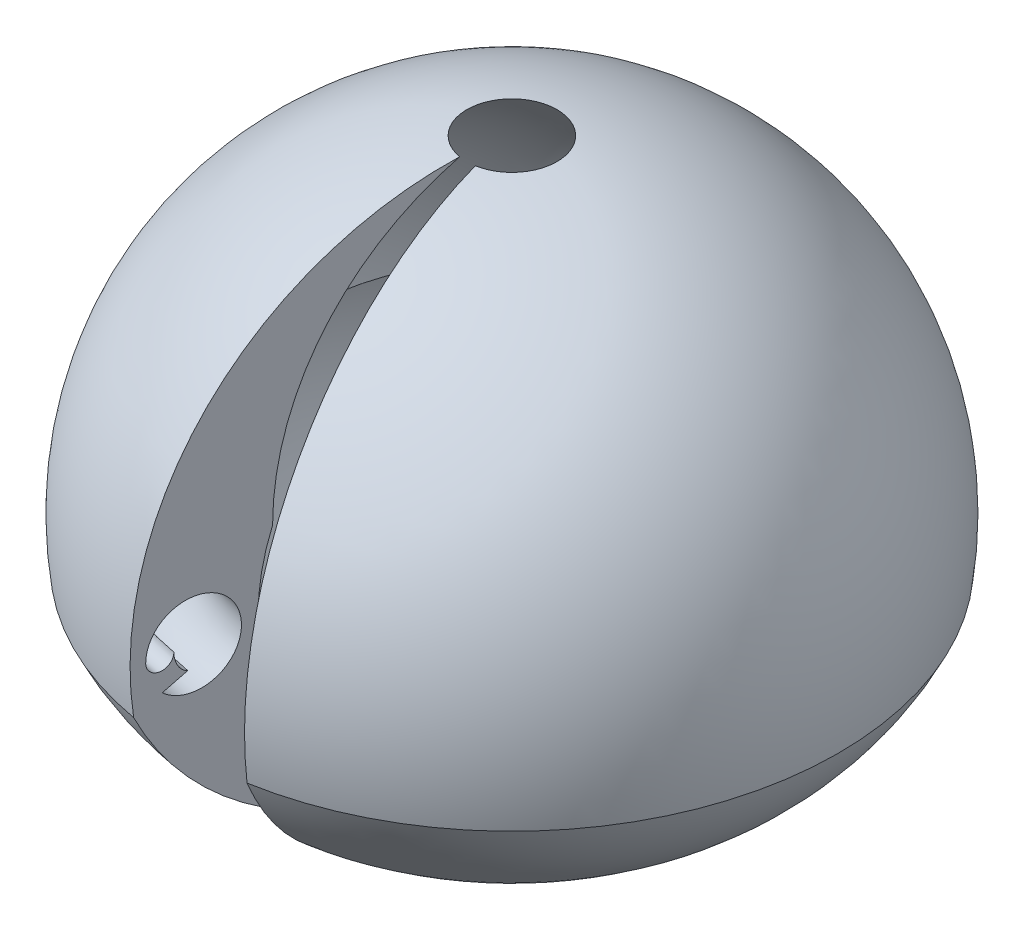
ISO-10303-21;
HEADER;
FILE_DESCRIPTION(('STEP AP214'),'2;1');
FILE_NAME('part.step','',(''),(''),'','','');
FILE_SCHEMA(('AUTOMOTIVE_DESIGN { 1 0 10303 214 1 1 1 1 }'));
ENDSEC;
DATA;
#1=APPLICATION_CONTEXT('core data for automotive mechanical design processes');
#2=APPLICATION_PROTOCOL_DEFINITION('international standard','automotive_design',2000,#1);
#3=PRODUCT_CONTEXT('',#1,'mechanical');
#4=PRODUCT('Part','Part','',(#3));
#5=PRODUCT_RELATED_PRODUCT_CATEGORY('part','',(#4));
#6=PRODUCT_DEFINITION_FORMATION('','',#4);
#7=PRODUCT_DEFINITION_CONTEXT('part definition',#1,'design');
#8=PRODUCT_DEFINITION('design','',#6,#7);
#9=PRODUCT_DEFINITION_SHAPE('','',#8);
#10=(LENGTH_UNIT() NAMED_UNIT(*) SI_UNIT(.MILLI.,.METRE.));
#11=(NAMED_UNIT(*) PLANE_ANGLE_UNIT() SI_UNIT($,.RADIAN.));
#12=(NAMED_UNIT(*) SI_UNIT($,.STERADIAN.) SOLID_ANGLE_UNIT());
#13=UNCERTAINTY_MEASURE_WITH_UNIT(LENGTH_MEASURE(1.E-05),#10,'distance_accuracy_value','');
#14=(GEOMETRIC_REPRESENTATION_CONTEXT(3) GLOBAL_UNCERTAINTY_ASSIGNED_CONTEXT((#13)) GLOBAL_UNIT_ASSIGNED_CONTEXT((#10,
#11,#12)) REPRESENTATION_CONTEXT('',''));
#15=CARTESIAN_POINT('',(0.,0.,0.));
#16=DIRECTION('',(0.,0.,1.));
#17=DIRECTION('',(1.,0.,0.));
#18=AXIS2_PLACEMENT_3D('',#15,#16,#17);
#19=CARTESIAN_POINT('',(-0.392444881527248,-0.0199999999999998,2.22566552180759));
#20=DIRECTION('',(-0.984807753012209,0.,-0.173648177666924));
#21=DIRECTION('',(0.,1.,0.));
#22=AXIS2_PLACEMENT_3D('',#19,#20,#21);
#23=ELLIPSE('',#22,0.180000000000001,0.14);
#24=CARTESIAN_POINT('',(0.,0.,0.));
#25=DIRECTION('',(0.,-1.,0.));
#26=AXIS1_PLACEMENT('',#24,#25);
#27=SURFACE_OF_REVOLUTION('',#23,#26);
#28=CARTESIAN_POINT('',(0.,-0.191903676408179,0.));
#29=DIRECTION('',(0.,-1.,0.));
#30=DIRECTION('',(0.,0.,-1.));
#31=AXIS2_PLACEMENT_3D('',#28,#29,#30);
#32=CIRCLE('',#31,2.30151560406185);
#33=CARTESIAN_POINT('',(-0.399653990517331,-0.191903676408179,2.26655041055869));
#34=VERTEX_POINT('',#33);
#35=CARTESIAN_POINT('',(0.399653990517331,-0.191903676408179,2.26655041055869));
#36=VERTEX_POINT('',#35);
#37=EDGE_CURVE('E11',#34,#36,#32,.T.);
#38=ORIENTED_EDGE('',*,*,#37,.T.);
#39=CARTESIAN_POINT('',(0.392444881527248,-0.0199999999999998,2.22566552180759));
#40=DIRECTION('',(-0.984807753012209,0.,0.173648177666924));
#41=DIRECTION('',(0.,1.,0.));
#42=AXIS2_PLACEMENT_3D('',#39,#40,#41);
#43=ELLIPSE('',#42,0.180000000000001,0.14);
#44=CARTESIAN_POINT('',(0.416755626400618,-0.0199999999999998,2.3635386072293));
#45=VERTEX_POINT('',#44);
#46=EDGE_CURVE('E133',#36,#45,#43,.T.);
#47=ORIENTED_EDGE('',*,*,#46,.T.);
#48=CARTESIAN_POINT('',(0.,-0.0199999999999998,0.));
#49=DIRECTION('',(0.,-1.,0.));
#50=DIRECTION('',(0.,0.,-1.));
#51=AXIS2_PLACEMENT_3D('',#48,#49,#50);
#52=CIRCLE('',#51,2.4);
#53=CARTESIAN_POINT('',(-0.416755626400618,-0.0199999999999998,2.3635386072293));
#54=VERTEX_POINT('',#53);
#55=EDGE_CURVE('E53',#54,#45,#52,.T.);
#56=ORIENTED_EDGE('',*,*,#55,.F.);
#57=EDGE_CURVE('E152',#34,#54,#23,.T.);
#58=ORIENTED_EDGE('',*,*,#57,.F.);
#59=EDGE_LOOP('',(#38,#47,#56,#58));
#60=FACE_BOUND('',#59,.T.);
#61=ADVANCED_FACE('F38',(#60),#27,.T.);
#62=CARTESIAN_POINT('',(0.,-0.191903676408179,0.));
#63=DIRECTION('',(0.,-1.,0.));
#64=DIRECTION('',(0.,0.,-1.));
#65=AXIS2_PLACEMENT_3D('',#62,#63,#64);
#66=CONICAL_SURFACE('',#65,2.30151560406185,1.13446401379631);
#67=CARTESIAN_POINT('',(0.,-0.276573915901747,0.));
#68=DIRECTION('',(0.,-1.,0.));
#69=DIRECTION('',(0.,0.,-1.));
#70=AXIS2_PLACEMENT_3D('',#67,#68,#69);
#71=CIRCLE('',#70,2.48309151861701);
#72=CARTESIAN_POINT('',(-0.431184317188039,-0.276573915901747,2.44536777897289));
#73=VERTEX_POINT('',#72);
#74=CARTESIAN_POINT('',(0.431184317188039,-0.276573915901747,2.44536777897289));
#75=VERTEX_POINT('',#74);
#76=EDGE_CURVE('E46',#73,#75,#71,.T.);
#77=ORIENTED_EDGE('',*,*,#76,.T.);
#78=DIRECTION('',(0.157378695624257,-0.4226182617407,0.892538935289031));
#79=VECTOR('',#78,1.);
#80=CARTESIAN_POINT('',(0.0586169519448804,0.723903128693275,0.332433253886417));
#81=LINE('',#80,#79);
#82=EDGE_CURVE('E135',#36,#75,#81,.T.);
#83=ORIENTED_EDGE('',*,*,#82,.F.);
#84=ORIENTED_EDGE('',*,*,#37,.F.);
#85=DIRECTION('',(-0.157378695624257,-0.4226182617407,0.892538935289031));
#86=VECTOR('',#85,1.);
#87=CARTESIAN_POINT('',(-0.0586169519448804,0.723903128693275,0.332433253886417));
#88=LINE('',#87,#86);
#89=EDGE_CURVE('E155',#34,#73,#88,.T.);
#90=ORIENTED_EDGE('',*,*,#89,.T.);
#91=EDGE_LOOP('',(#77,#83,#84,#90));
#92=FACE_BOUND('',#91,.T.);
#93=ADVANCED_FACE('F40',(#92),#66,.F.);
#94=CARTESIAN_POINT('',(0.,-0.0199999999999998,0.));
#95=DIRECTION('',(0.,-1.,0.));
#96=DIRECTION('',(0.,0.,-1.));
#97=AXIS2_PLACEMENT_3D('',#94,#95,#96);
#98=TOROIDAL_SURFACE('',#97,2.26,0.34);
#99=CARTESIAN_POINT('',(0.,-0.0199999999999998,0.));
#100=DIRECTION('',(0.,-1.,0.));
#101=DIRECTION('',(0.,0.,-1.));
#102=AXIS2_PLACEMENT_3D('',#99,#100,#101);
#103=CIRCLE('',#102,2.6);
#104=CARTESIAN_POINT('',(-0.451485261934003,-0.0199999999999998,2.56050015783174));
#105=VERTEX_POINT('',#104);
#106=CARTESIAN_POINT('',(0.451485261934003,-0.0199999999999998,2.56050015783174));
#107=VERTEX_POINT('',#106);
#108=EDGE_CURVE('E61',#105,#107,#103,.T.);
#109=ORIENTED_EDGE('',*,*,#108,.T.);
#110=CARTESIAN_POINT('',(0.392444881527248,-0.0199999999999998,2.22566552180759));
#111=DIRECTION('',(-0.984807753012209,0.,0.173648177666924));
#112=DIRECTION('',(0.173648177666924,0.,0.984807753012209));
#113=AXIS2_PLACEMENT_3D('',#110,#111,#112);
#114=CIRCLE('',#113,0.34);
#115=EDGE_CURVE('E138',#107,#75,#114,.T.);
#116=ORIENTED_EDGE('',*,*,#115,.T.);
#117=ORIENTED_EDGE('',*,*,#76,.F.);
#118=CARTESIAN_POINT('',(-0.392444881527248,-0.0199999999999998,2.22566552180759));
#119=DIRECTION('',(-0.984807753012209,0.,-0.173648177666924));
#120=DIRECTION('',(-0.173648177666924,0.,0.984807753012209));
#121=AXIS2_PLACEMENT_3D('',#118,#119,#120);
#122=CIRCLE('',#121,0.34);
#123=EDGE_CURVE('E177',#105,#73,#122,.T.);
#124=ORIENTED_EDGE('',*,*,#123,.F.);
#125=EDGE_LOOP('',(#109,#116,#117,#124));
#126=FACE_BOUND('',#125,.T.);
#127=ADVANCED_FACE('F166',(#126),#98,.F.);
#128=CARTESIAN_POINT('',(0.,0.601040764008566,0.));
#129=DIRECTION('',(0.,-1.,0.));
#130=DIRECTION('',(0.,0.,-1.));
#131=AXIS2_PLACEMENT_3D('',#128,#129,#130);
#132=DEGENERATE_TOROIDAL_SURFACE('',#131,0.601040764008564,2.3,.T.);
#133=CARTESIAN_POINT('',(0.,-0.370981237995043,0.));
#134=DIRECTION('',(0.,-1.,0.));
#135=DIRECTION('',(0.,0.,-1.));
#136=AXIS2_PLACEMENT_3D('',#133,#134,#135);
#137=CIRCLE('',#136,2.68554867419286);
#138=CARTESIAN_POINT('',(-0.466340633309414,-0.370981237995043,2.64474915543679));
#139=VERTEX_POINT('',#138);
#140=CARTESIAN_POINT('',(0.466340633309414,-0.370981237995043,2.64474915543679));
#141=VERTEX_POINT('',#140);
#142=EDGE_CURVE('E104',#139,#141,#137,.T.);
#143=ORIENTED_EDGE('',*,*,#142,.T.);
#144=CARTESIAN_POINT('',(0.104369633373623,0.601040764008566,0.591909604272016));
#145=DIRECTION('',(-0.984807753012209,0.,0.173648177666924));
#146=DIRECTION('',(0.173648177666924,0.,0.984807753012209));
#147=AXIS2_PLACEMENT_3D('',#144,#145,#146);
#148=CIRCLE('',#147,2.3);
#149=CARTESIAN_POINT('',(0.104369633373622,-1.69895923599143,0.591909604272008));
#150=VERTEX_POINT('',#149);
#151=EDGE_CURVE('E107',#141,#150,#148,.F.);
#152=ORIENTED_EDGE('',*,*,#151,.T.);
#153=CARTESIAN_POINT('',(0.,-1.69895923599143,0.));
#154=DIRECTION('',(0.,-1.,0.));
#155=DIRECTION('',(0.,0.,-1.));
#156=AXIS2_PLACEMENT_3D('',#153,#154,#155);
#157=CIRCLE('',#156,0.601040764008557);
#158=CARTESIAN_POINT('',(-0.104369633373622,-1.69895923599143,0.591909604272008));
#159=VERTEX_POINT('',#158);
#160=EDGE_CURVE('E191',#159,#150,#157,.T.);
#161=ORIENTED_EDGE('',*,*,#160,.F.);
#162=CARTESIAN_POINT('',(-0.104369633373623,0.601040764008566,0.591909604272016));
#163=DIRECTION('',(-0.984807753012209,0.,-0.173648177666924));
#164=DIRECTION('',(-0.173648177666924,0.,0.984807753012209));
#165=AXIS2_PLACEMENT_3D('',#162,#163,#164);
#166=CIRCLE('',#165,2.3);
#167=EDGE_CURVE('E110',#139,#159,#166,.F.);
#168=ORIENTED_EDGE('',*,*,#167,.F.);
#169=EDGE_LOOP('',(#143,#152,#161,#168));
#170=FACE_BOUND('',#169,.T.);
#171=ADVANCED_FACE('F106',(#170),#132,.T.);
#172=CARTESIAN_POINT('',(0.,0.,0.));
#173=DIRECTION('',(0.,-1.,0.));
#174=DIRECTION('',(-0.173648177666924,0.,0.984807753012209));
#175=AXIS2_PLACEMENT_3D('',#172,#173,#174);
#176=SPHERICAL_SURFACE('',#175,2.71105122791941);
#177=CARTESIAN_POINT('',(0.,2.68554867419286,0.));
#178=DIRECTION('',(0.,-1.,0.));
#179=DIRECTION('',(0.,0.,-1.));
#180=AXIS2_PLACEMENT_3D('',#177,#178,#179);
#181=CIRCLE('',#180,0.370981237995044);
#182=CARTESIAN_POINT('',(-0.0644202159264589,2.68554867419286,0.365345199399587));
#183=VERTEX_POINT('',#182);
#184=CARTESIAN_POINT('',(0.0644202159264589,2.68554867419286,0.365345199399587));
#185=VERTEX_POINT('',#184);
#186=EDGE_CURVE('E115',#183,#185,#181,.T.);
#187=ORIENTED_EDGE('',*,*,#186,.T.);
#188=CARTESIAN_POINT('',(0.,0.,0.));
#189=DIRECTION('',(-0.984807753012209,0.,0.173648177666924));
#190=DIRECTION('',(0.173648177666924,0.,0.984807753012209));
#191=AXIS2_PLACEMENT_3D('',#188,#189,#190);
#192=CIRCLE('',#191,2.71105122791941);
#193=EDGE_CURVE('E122',#185,#141,#192,.F.);
#194=ORIENTED_EDGE('',*,*,#193,.T.);
#195=ORIENTED_EDGE('',*,*,#142,.F.);
#196=CARTESIAN_POINT('',(0.,0.,0.));
#197=DIRECTION('',(-0.984807753012209,0.,-0.173648177666924));
#198=DIRECTION('',(-0.173648177666924,0.,0.984807753012209));
#199=AXIS2_PLACEMENT_3D('',#196,#197,#198);
#200=CIRCLE('',#199,2.71105122791941);
#201=EDGE_CURVE('E144',#183,#139,#200,.F.);
#202=ORIENTED_EDGE('',*,*,#201,.F.);
#203=EDGE_LOOP('',(#187,#194,#195,#202));
#204=FACE_BOUND('',#203,.T.);
#205=ADVANCED_FACE('F127',(#204),#176,.T.);
#206=CARTESIAN_POINT('',(0.,0.601040764008564,0.));
#207=DIRECTION('',(0.,-1.,0.));
#208=DIRECTION('',(0.,0.,-1.));
#209=AXIS2_PLACEMENT_3D('',#206,#207,#208);
#210=DEGENERATE_TOROIDAL_SURFACE('',#209,0.601040764008566,2.3,.F.);
#211=CARTESIAN_POINT('',(0.,0.601040764008558,0.));
#212=DIRECTION('',(0.,-1.,0.));
#213=DIRECTION('',(0.,0.,-1.));
#214=AXIS2_PLACEMENT_3D('',#211,#212,#213);
#215=CIRCLE('',#214,1.69895923599143);
#216=CARTESIAN_POINT('',(-0.295021175260302,0.601040764008558,1.67314822765606));
#217=VERTEX_POINT('',#216);
#218=CARTESIAN_POINT('',(0.295021175260302,0.601040764008558,1.67314822765606));
#219=VERTEX_POINT('',#218);
#220=EDGE_CURVE('E189',#217,#219,#215,.T.);
#221=ORIENTED_EDGE('',*,*,#220,.T.);
#222=CARTESIAN_POINT('',(-0.104369633373623,0.601040764008564,-0.591909604272018));
#223=DIRECTION('',(-0.984807753012209,0.,0.173648177666924));
#224=DIRECTION('',(0.173648177666924,0.,0.984807753012209));
#225=AXIS2_PLACEMENT_3D('',#222,#223,#224);
#226=CIRCLE('',#225,2.3);
#227=EDGE_CURVE('E128',#185,#219,#226,.F.);
#228=ORIENTED_EDGE('',*,*,#227,.F.);
#229=ORIENTED_EDGE('',*,*,#186,.F.);
#230=CARTESIAN_POINT('',(0.104369633373623,0.601040764008564,-0.591909604272018));
#231=DIRECTION('',(-0.984807753012209,0.,-0.173648177666924));
#232=DIRECTION('',(-0.173648177666924,0.,0.984807753012209));
#233=AXIS2_PLACEMENT_3D('',#230,#231,#232);
#234=CIRCLE('',#233,2.3);
#235=EDGE_CURVE('E146',#183,#217,#234,.F.);
#236=ORIENTED_EDGE('',*,*,#235,.T.);
#237=EDGE_LOOP('',(#221,#228,#229,#236));
#238=FACE_BOUND('',#237,.T.);
#239=ADVANCED_FACE('F203',(#238),#210,.T.);
#240=CARTESIAN_POINT('',(0.,0.,0.));
#241=DIRECTION('',(0.,-1.,0.));
#242=DIRECTION('',(-0.173648177666924,0.,0.984807753012209));
#243=AXIS2_PLACEMENT_3D('',#240,#241,#242);
#244=SPHERICAL_SURFACE('',#243,1.80214108370033);
#245=CARTESIAN_POINT('',(0.,0.,0.));
#246=DIRECTION('',(-0.984807753012209,0.,-0.173648177666924));
#247=DIRECTION('',(-0.173648177666924,0.,0.984807753012209));
#248=AXIS2_PLACEMENT_3D('',#245,#246,#247);
#249=CIRCLE('',#248,1.80214108370033);
#250=EDGE_CURVE('E149',#217,#159,#249,.F.);
#251=ORIENTED_EDGE('',*,*,#250,.T.);
#252=ORIENTED_EDGE('',*,*,#160,.T.);
#253=CARTESIAN_POINT('',(0.,0.,0.));
#254=DIRECTION('',(-0.984807753012209,0.,0.173648177666924));
#255=DIRECTION('',(0.173648177666924,0.,0.984807753012209));
#256=AXIS2_PLACEMENT_3D('',#253,#254,#255);
#257=CIRCLE('',#256,1.80214108370033);
#258=EDGE_CURVE('E125',#219,#150,#257,.F.);
#259=ORIENTED_EDGE('',*,*,#258,.F.);
#260=ORIENTED_EDGE('',*,*,#220,.F.);
#261=EDGE_LOOP('',(#251,#252,#259,#260));
#262=FACE_BOUND('',#261,.T.);
#263=ADVANCED_FACE('F165',(#262),#244,.F.);
#264=CARTESIAN_POINT('',(0.,-0.0199999999999998,0.));
#265=DIRECTION('',(0.,-1.,0.));
#266=DIRECTION('',(0.,0.,-1.));
#267=AXIS2_PLACEMENT_3D('',#264,#265,#266);
#268=TOROIDAL_SURFACE('',#267,2.5,0.0999999999999998);
#269=CARTESIAN_POINT('',(-0.43412044416731,-0.0199999999999998,2.46201938253052));
#270=DIRECTION('',(-0.984807753012209,0.,-0.173648177666924));
#271=DIRECTION('',(-0.173648177666924,0.,0.984807753012209));
#272=AXIS2_PLACEMENT_3D('',#269,#270,#271);
#273=CIRCLE('',#272,0.0999999999999998);
#274=EDGE_CURVE('E183',#54,#105,#273,.T.);
#275=ORIENTED_EDGE('',*,*,#274,.F.);
#276=ORIENTED_EDGE('',*,*,#55,.T.);
#277=CARTESIAN_POINT('',(0.43412044416731,-0.0199999999999998,2.46201938253052));
#278=DIRECTION('',(-0.984807753012209,0.,0.173648177666924));
#279=DIRECTION('',(0.173648177666924,0.,0.984807753012209));
#280=AXIS2_PLACEMENT_3D('',#277,#278,#279);
#281=CIRCLE('',#280,0.0999999999999998);
#282=EDGE_CURVE('E141',#45,#107,#281,.T.);
#283=ORIENTED_EDGE('',*,*,#282,.T.);
#284=ORIENTED_EDGE('',*,*,#108,.F.);
#285=EDGE_LOOP('',(#275,#276,#283,#284));
#286=FACE_BOUND('',#285,.T.);
#287=ADVANCED_FACE('F162',(#286),#268,.F.);
#288=CARTESIAN_POINT('',(0.,0.,0.));
#289=DIRECTION('',(-0.984807753012209,0.,-0.173648177666924));
#290=DIRECTION('',(-0.173648177666924,0.,0.984807753012209));
#291=AXIS2_PLACEMENT_3D('',#288,#289,#290);
#292=PLANE('',#291);
#293=ORIENTED_EDGE('',*,*,#167,.T.);
#294=ORIENTED_EDGE('',*,*,#250,.F.);
#295=ORIENTED_EDGE('',*,*,#235,.F.);
#296=ORIENTED_EDGE('',*,*,#201,.T.);
#297=EDGE_LOOP('',(#293,#294,#295,#296));
#298=FACE_BOUND('',#297,.T.);
#299=ORIENTED_EDGE('',*,*,#57,.T.);
#300=ORIENTED_EDGE('',*,*,#274,.T.);
#301=ORIENTED_EDGE('',*,*,#123,.T.);
#302=ORIENTED_EDGE('',*,*,#89,.F.);
#303=EDGE_LOOP('',(#299,#300,#301,#302));
#304=FACE_BOUND('',#303,.T.);
#305=ADVANCED_FACE('F164',(#298,#304),#292,.F.);
#306=CARTESIAN_POINT('',(0.,0.,0.));
#307=DIRECTION('',(-0.984807753012209,0.,0.173648177666924));
#308=DIRECTION('',(0.173648177666924,0.,0.984807753012209));
#309=AXIS2_PLACEMENT_3D('',#306,#307,#308);
#310=PLANE('',#309);
#311=ORIENTED_EDGE('',*,*,#151,.F.);
#312=ORIENTED_EDGE('',*,*,#193,.F.);
#313=ORIENTED_EDGE('',*,*,#227,.T.);
#314=ORIENTED_EDGE('',*,*,#258,.T.);
#315=EDGE_LOOP('',(#311,#312,#313,#314));
#316=FACE_BOUND('',#315,.T.);
#317=ORIENTED_EDGE('',*,*,#46,.F.);
#318=ORIENTED_EDGE('',*,*,#82,.T.);
#319=ORIENTED_EDGE('',*,*,#115,.F.);
#320=ORIENTED_EDGE('',*,*,#282,.F.);
#321=EDGE_LOOP('',(#317,#318,#319,#320));
#322=FACE_BOUND('',#321,.T.);
#323=ADVANCED_FACE('F119',(#316,#322),#310,.T.);
#324=CLOSED_SHELL('',(#61,#93,#127,#171,#205,#239,#263,#287,#305,#323));
#325=MANIFOLD_SOLID_BREP('B2',#324);
#326=ADVANCED_BREP_SHAPE_REPRESENTATION('',(#18,#325),#14);
#327=SHAPE_DEFINITION_REPRESENTATION(#9,#326);
ENDSEC;
END-ISO-10303-21;
